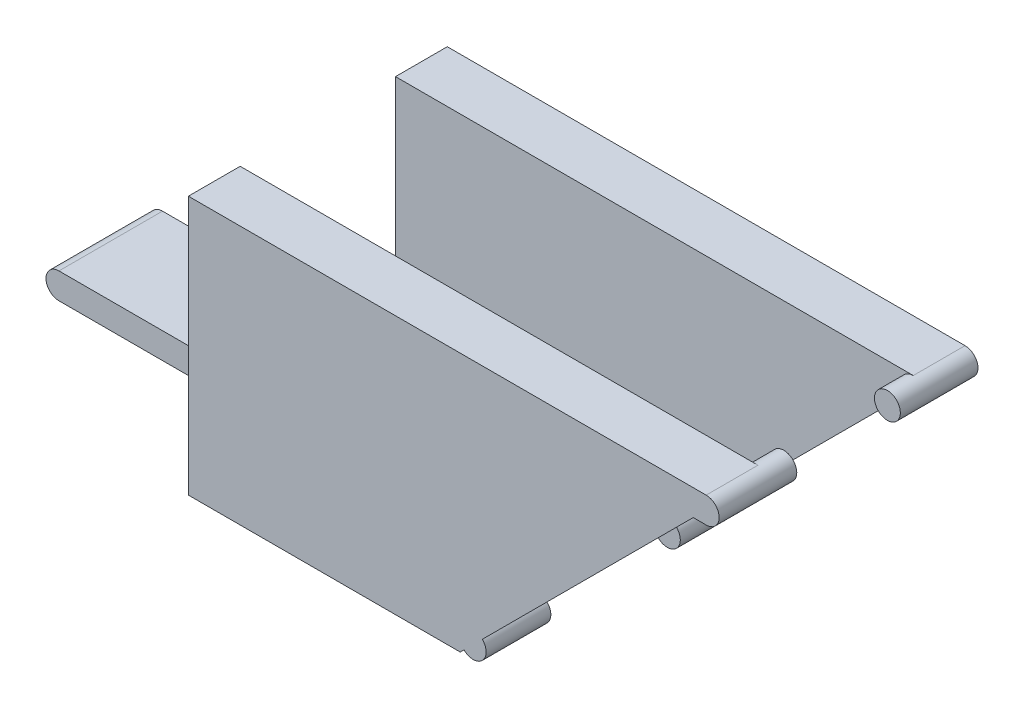
ISO-10303-21;
HEADER;
FILE_DESCRIPTION(('STEP AP214'),'2;1');
FILE_NAME('part.step','',(''),(''),'','','');
FILE_SCHEMA(('AUTOMOTIVE_DESIGN { 1 0 10303 214 1 1 1 1 }'));
ENDSEC;
DATA;
#1=APPLICATION_CONTEXT('core data for automotive mechanical design processes');
#2=APPLICATION_PROTOCOL_DEFINITION('international standard','automotive_design',2000,#1);
#3=PRODUCT_CONTEXT('',#1,'mechanical');
#4=PRODUCT('Part','Part','',(#3));
#5=PRODUCT_RELATED_PRODUCT_CATEGORY('part','',(#4));
#6=PRODUCT_DEFINITION_FORMATION('','',#4);
#7=PRODUCT_DEFINITION_CONTEXT('part definition',#1,'design');
#8=PRODUCT_DEFINITION('design','',#6,#7);
#9=PRODUCT_DEFINITION_SHAPE('','',#8);
#10=(LENGTH_UNIT() NAMED_UNIT(*) SI_UNIT(.MILLI.,.METRE.));
#11=(NAMED_UNIT(*) PLANE_ANGLE_UNIT() SI_UNIT($,.RADIAN.));
#12=(NAMED_UNIT(*) SI_UNIT($,.STERADIAN.) SOLID_ANGLE_UNIT());
#13=UNCERTAINTY_MEASURE_WITH_UNIT(LENGTH_MEASURE(1.E-05),#10,'distance_accuracy_value','');
#14=(GEOMETRIC_REPRESENTATION_CONTEXT(3) GLOBAL_UNCERTAINTY_ASSIGNED_CONTEXT((#13)) GLOBAL_UNIT_ASSIGNED_CONTEXT((#10,
#11,#12)) REPRESENTATION_CONTEXT('',''));
#15=CARTESIAN_POINT('',(0.,0.,0.));
#16=DIRECTION('',(0.,0.,1.));
#17=DIRECTION('',(1.,0.,0.));
#18=AXIS2_PLACEMENT_3D('',#15,#16,#17);
#19=CARTESIAN_POINT('',(37.,18.,-10.));
#20=DIRECTION('',(-0.707106781186553,0.707106781186542,0.));
#21=DIRECTION('',(-0.707106781186542,-0.707106781186553,0.));
#22=AXIS2_PLACEMENT_3D('',#19,#20,#21);
#23=PLANE('',#22);
#24=DIRECTION('',(0.707106781186542,0.707106781186553,0.));
#25=VECTOR('',#24,1.);
#26=CARTESIAN_POINT('',(39.6624393450778,20.6624393450778,-6.));
#27=LINE('',#26,#25);
#28=CARTESIAN_POINT('',(20.7071067811867,1.7071067811864,-6.));
#29=VERTEX_POINT('',#28);
#30=CARTESIAN_POINT('',(37.,18.,-6.));
#31=VERTEX_POINT('',#30);
#32=EDGE_CURVE('E206',#29,#31,#27,.T.);
#33=ORIENTED_EDGE('',*,*,#32,.F.);
#34=DIRECTION('',(0.,0.,-1.));
#35=VECTOR('',#34,1.);
#36=CARTESIAN_POINT('',(20.7071067811867,1.7071067811864,-5.));
#37=LINE('',#36,#35);
#38=CARTESIAN_POINT('',(20.7071067811867,1.7071067811864,-10.));
#39=VERTEX_POINT('',#38);
#40=EDGE_CURVE('E11',#29,#39,#37,.T.);
#41=ORIENTED_EDGE('',*,*,#40,.T.);
#42=DIRECTION('',(-0.707106781186542,-0.707106781186553,0.));
#43=VECTOR('',#42,1.);
#44=CARTESIAN_POINT('',(37.,18.,-10.));
#45=LINE('',#44,#43);
#46=CARTESIAN_POINT('',(37.,18.,-10.));
#47=VERTEX_POINT('',#46);
#48=EDGE_CURVE('E204',#47,#39,#45,.T.);
#49=ORIENTED_EDGE('',*,*,#48,.F.);
#50=DIRECTION('',(0.,0.,1.));
#51=VECTOR('',#50,1.);
#52=CARTESIAN_POINT('',(37.,18.,-10.));
#53=LINE('',#52,#51);
#54=EDGE_CURVE('E223',#47,#31,#53,.T.);
#55=ORIENTED_EDGE('',*,*,#54,.T.);
#56=EDGE_LOOP('',(#33,#41,#49,#55));
#57=FACE_BOUND('',#56,.T.);
#58=ADVANCED_FACE('F34',(#57),#23,.F.);
#59=DIRECTION('',(-0.707106781186542,-0.707106781186553,0.));
#60=VECTOR('',#59,1.);
#61=CARTESIAN_POINT('',(39.6624393450778,20.6624393450778,6.));
#62=LINE('',#61,#60);
#63=CARTESIAN_POINT('',(19.2928932188136,0.292893218813289,6.));
#64=VERTEX_POINT('',#63);
#65=CARTESIAN_POINT('',(19.0000000000003,0.,6.));
#66=VERTEX_POINT('',#65);
#67=EDGE_CURVE('E364',#64,#66,#62,.T.);
#68=ORIENTED_EDGE('',*,*,#67,.F.);
#69=DIRECTION('',(0.,0.,1.));
#70=VECTOR('',#69,1.);
#71=CARTESIAN_POINT('',(19.2928932188136,0.292893218813291,5.));
#72=LINE('',#71,#70);
#73=CARTESIAN_POINT('',(19.2928932188136,0.292893218813291,10.));
#74=VERTEX_POINT('',#73);
#75=EDGE_CURVE('E369',#64,#74,#72,.T.);
#76=ORIENTED_EDGE('',*,*,#75,.T.);
#77=DIRECTION('',(-0.707106781186542,-0.707106781186553,0.));
#78=VECTOR('',#77,1.);
#79=CARTESIAN_POINT('',(37.,18.,10.));
#80=LINE('',#79,#78);
#81=CARTESIAN_POINT('',(19.0000000000003,0.,10.));
#82=VERTEX_POINT('',#81);
#83=EDGE_CURVE('E220',#74,#82,#80,.T.);
#84=ORIENTED_EDGE('',*,*,#83,.T.);
#85=DIRECTION('',(0.,0.,1.));
#86=VECTOR('',#85,1.);
#87=CARTESIAN_POINT('',(19.0000000000003,0.,-10.));
#88=LINE('',#87,#86);
#89=EDGE_CURVE('E212',#66,#82,#88,.T.);
#90=ORIENTED_EDGE('',*,*,#89,.F.);
#91=EDGE_LOOP('',(#68,#76,#84,#90));
#92=FACE_BOUND('',#91,.T.);
#93=ADVANCED_FACE('F482',(#92),#23,.F.);
#94=CARTESIAN_POINT('',(38.,19.,10.));
#95=DIRECTION('',(0.,0.,-1.));
#96=DIRECTION('',(-1.,0.,0.));
#97=AXIS2_PLACEMENT_3D('',#94,#95,#96);
#98=CYLINDRICAL_SURFACE('',#97,0.999999999999998);
#99=CARTESIAN_POINT('',(38.,19.,4.00000000000001));
#100=DIRECTION('',(0.,0.,1.));
#101=DIRECTION('',(1.,0.,0.));
#102=AXIS2_PLACEMENT_3D('',#99,#100,#101);
#103=CIRCLE('',#102,0.999999999999998);
#104=CARTESIAN_POINT('',(39.,19.,4.00000000000001));
#105=VERTEX_POINT('',#104);
#106=EDGE_CURVE('E262',#105,#105,#103,.T.);
#107=ORIENTED_EDGE('',*,*,#106,.T.);
#108=EDGE_LOOP('',(#107));
#109=FACE_BOUND('',#108,.T.);
#110=CARTESIAN_POINT('',(38.,19.,10.));
#111=DIRECTION('',(0.,0.,1.));
#112=DIRECTION('',(1.,0.,0.));
#113=AXIS2_PLACEMENT_3D('',#110,#111,#112);
#114=CIRCLE('',#113,0.999999999999998);
#115=CARTESIAN_POINT('',(38.,18.,10.));
#116=VERTEX_POINT('',#115);
#117=CARTESIAN_POINT('',(38.,20.,10.));
#118=VERTEX_POINT('',#117);
#119=EDGE_CURVE('E266',#116,#118,#114,.T.);
#120=ORIENTED_EDGE('',*,*,#119,.F.);
#121=DIRECTION('',(0.,0.,-1.));
#122=VECTOR('',#121,1.);
#123=CARTESIAN_POINT('',(38.,18.,10.));
#124=LINE('',#123,#122);
#125=CARTESIAN_POINT('',(38.,18.,6.));
#126=VERTEX_POINT('',#125);
#127=EDGE_CURVE('E269',#116,#126,#124,.T.);
#128=ORIENTED_EDGE('',*,*,#127,.T.);
#129=CARTESIAN_POINT('',(38.,19.,6.));
#130=DIRECTION('',(0.,0.,1.));
#131=DIRECTION('',(0.,-1.,0.));
#132=AXIS2_PLACEMENT_3D('',#129,#130,#131);
#133=CIRCLE('',#132,0.999999999999998);
#134=CARTESIAN_POINT('',(38.,20.,6.));
#135=VERTEX_POINT('',#134);
#136=EDGE_CURVE('E358',#126,#135,#133,.F.);
#137=ORIENTED_EDGE('',*,*,#136,.T.);
#138=DIRECTION('',(0.,0.,-1.));
#139=VECTOR('',#138,1.);
#140=CARTESIAN_POINT('',(38.,20.,-10.));
#141=LINE('',#140,#139);
#142=EDGE_CURVE('E335',#118,#135,#141,.T.);
#143=ORIENTED_EDGE('',*,*,#142,.F.);
#144=EDGE_LOOP('',(#120,#128,#137,#143));
#145=FACE_BOUND('',#144,.T.);
#146=ADVANCED_FACE('F449',(#109,#145),#98,.T.);
#147=CARTESIAN_POINT('',(-18.,4.,-4.));
#148=DIRECTION('',(0.,-1.,0.));
#149=DIRECTION('',(0.,0.,-1.));
#150=AXIS2_PLACEMENT_3D('',#147,#148,#149);
#151=PLANE('',#150);
#152=DIRECTION('',(0.,0.,1.));
#153=VECTOR('',#152,1.);
#154=CARTESIAN_POINT('',(18.,4.,5.99999999999999));
#155=LINE('',#154,#153);
#156=CARTESIAN_POINT('',(18.,4.,-6.00000000000001));
#157=VERTEX_POINT('',#156);
#158=CARTESIAN_POINT('',(18.,4.,6.));
#159=VERTEX_POINT('',#158);
#160=EDGE_CURVE('E288',#157,#159,#155,.T.);
#161=ORIENTED_EDGE('',*,*,#160,.F.);
#162=DIRECTION('',(-1.,0.,0.));
#163=VECTOR('',#162,1.);
#164=CARTESIAN_POINT('',(38.,4.,-6.));
#165=LINE('',#164,#163);
#166=CARTESIAN_POINT('',(-1.99999999999999,4.,-6.));
#167=VERTEX_POINT('',#166);
#168=EDGE_CURVE('E304',#157,#167,#165,.T.);
#169=ORIENTED_EDGE('',*,*,#168,.T.);
#170=DIRECTION('',(0.,0.,1.));
#171=VECTOR('',#170,1.);
#172=CARTESIAN_POINT('',(-1.99999999999999,4.,-6.));
#173=LINE('',#172,#171);
#174=CARTESIAN_POINT('',(-1.99999999999999,4.,-4.));
#175=VERTEX_POINT('',#174);
#176=EDGE_CURVE('E300',#167,#175,#173,.T.);
#177=ORIENTED_EDGE('',*,*,#176,.T.);
#178=DIRECTION('',(1.,0.,0.));
#179=VECTOR('',#178,1.);
#180=CARTESIAN_POINT('',(-18.,4.,-4.));
#181=LINE('',#180,#179);
#182=CARTESIAN_POINT('',(-18.,4.,-4.));
#183=VERTEX_POINT('',#182);
#184=EDGE_CURVE('E312',#183,#175,#181,.T.);
#185=ORIENTED_EDGE('',*,*,#184,.F.);
#186=DIRECTION('',(0.,0.,-1.));
#187=VECTOR('',#186,1.);
#188=CARTESIAN_POINT('',(-18.,4.,-4.));
#189=LINE('',#188,#187);
#190=CARTESIAN_POINT('',(-18.,4.,4.));
#191=VERTEX_POINT('',#190);
#192=EDGE_CURVE('E309',#191,#183,#189,.T.);
#193=ORIENTED_EDGE('',*,*,#192,.F.);
#194=DIRECTION('',(1.,0.,0.));
#195=VECTOR('',#194,1.);
#196=CARTESIAN_POINT('',(-18.,4.,4.));
#197=LINE('',#196,#195);
#198=CARTESIAN_POINT('',(-1.99999999999999,4.,4.));
#199=VERTEX_POINT('',#198);
#200=EDGE_CURVE('E320',#191,#199,#197,.T.);
#201=ORIENTED_EDGE('',*,*,#200,.T.);
#202=CARTESIAN_POINT('',(-1.99999999999999,4.,6.));
#203=VERTEX_POINT('',#202);
#204=EDGE_CURVE('E299',#199,#203,#173,.T.);
#205=ORIENTED_EDGE('',*,*,#204,.T.);
#206=DIRECTION('',(-1.,0.,0.));
#207=VECTOR('',#206,1.);
#208=CARTESIAN_POINT('',(38.,4.,6.));
#209=LINE('',#208,#207);
#210=EDGE_CURVE('E305',#159,#203,#209,.T.);
#211=ORIENTED_EDGE('',*,*,#210,.F.);
#212=EDGE_LOOP('',(#161,#169,#177,#185,#193,#201,#205,#211));
#213=FACE_BOUND('',#212,.T.);
#214=ADVANCED_FACE('F403',(#213),#151,.F.);
#215=CARTESIAN_POINT('',(-1.99999999999999,20.,-10.));
#216=DIRECTION('',(1.,0.,0.));
#217=DIRECTION('',(0.,0.,-1.));
#218=AXIS2_PLACEMENT_3D('',#215,#216,#217);
#219=PLANE('',#218);
#220=DIRECTION('',(0.,0.,1.));
#221=VECTOR('',#220,1.);
#222=CARTESIAN_POINT('',(-1.99999999999999,20.,-10.));
#223=LINE('',#222,#221);
#224=CARTESIAN_POINT('',(-1.99999999999999,20.,6.));
#225=VERTEX_POINT('',#224);
#226=CARTESIAN_POINT('',(-1.99999999999999,20.,10.));
#227=VERTEX_POINT('',#226);
#228=EDGE_CURVE('E332',#225,#227,#223,.T.);
#229=ORIENTED_EDGE('',*,*,#228,.F.);
#230=DIRECTION('',(0.,1.,0.));
#231=VECTOR('',#230,1.);
#232=CARTESIAN_POINT('',(-1.99999999999999,22.3248786901555,6.));
#233=LINE('',#232,#231);
#234=EDGE_CURVE('E302',#203,#225,#233,.T.);
#235=ORIENTED_EDGE('',*,*,#234,.F.);
#236=ORIENTED_EDGE('',*,*,#204,.F.);
#237=DIRECTION('',(0.,1.,0.));
#238=VECTOR('',#237,1.);
#239=CARTESIAN_POINT('',(-1.99999999999999,0.,4.));
#240=LINE('',#239,#238);
#241=CARTESIAN_POINT('',(-1.99999999999999,0.,4.));
#242=VERTEX_POINT('',#241);
#243=EDGE_CURVE('E313',#242,#199,#240,.T.);
#244=ORIENTED_EDGE('',*,*,#243,.F.);
#245=DIRECTION('',(0.,0.,1.));
#246=VECTOR('',#245,1.);
#247=CARTESIAN_POINT('',(-1.99999999999999,0.,-10.));
#248=LINE('',#247,#246);
#249=CARTESIAN_POINT('',(-1.99999999999999,0.,10.));
#250=VERTEX_POINT('',#249);
#251=EDGE_CURVE('E327',#242,#250,#248,.T.);
#252=ORIENTED_EDGE('',*,*,#251,.T.);
#253=DIRECTION('',(0.,-1.,0.));
#254=VECTOR('',#253,1.);
#255=CARTESIAN_POINT('',(-1.99999999999999,20.,10.));
#256=LINE('',#255,#254);
#257=EDGE_CURVE('E350',#227,#250,#256,.T.);
#258=ORIENTED_EDGE('',*,*,#257,.F.);
#259=EDGE_LOOP('',(#229,#235,#236,#244,#252,#258));
#260=FACE_BOUND('',#259,.T.);
#261=ADVANCED_FACE('F423',(#260),#219,.F.);
#262=CARTESIAN_POINT('',(0.,20.,0.));
#263=DIRECTION('',(0.,1.,0.));
#264=DIRECTION('',(0.,0.,1.));
#265=AXIS2_PLACEMENT_3D('',#262,#263,#264);
#266=PLANE('',#265);
#267=DIRECTION('',(-1.,0.,0.));
#268=VECTOR('',#267,1.);
#269=CARTESIAN_POINT('',(0.,20.,-6.));
#270=LINE('',#269,#268);
#271=CARTESIAN_POINT('',(38.,20.,-6.));
#272=VERTEX_POINT('',#271);
#273=CARTESIAN_POINT('',(-1.99999999999999,20.,-6.));
#274=VERTEX_POINT('',#273);
#275=EDGE_CURVE('E356',#272,#274,#270,.T.);
#276=ORIENTED_EDGE('',*,*,#275,.F.);
#277=CARTESIAN_POINT('',(38.,20.,-10.));
#278=VERTEX_POINT('',#277);
#279=EDGE_CURVE('E334',#272,#278,#141,.T.);
#280=ORIENTED_EDGE('',*,*,#279,.T.);
#281=DIRECTION('',(-1.,0.,0.));
#282=VECTOR('',#281,1.);
#283=CARTESIAN_POINT('',(-1.99999999999999,20.,-10.));
#284=LINE('',#283,#282);
#285=CARTESIAN_POINT('',(-1.99999999999999,20.,-10.));
#286=VERTEX_POINT('',#285);
#287=EDGE_CURVE('E337',#278,#286,#284,.T.);
#288=ORIENTED_EDGE('',*,*,#287,.T.);
#289=EDGE_CURVE('E328',#286,#274,#223,.T.);
#290=ORIENTED_EDGE('',*,*,#289,.T.);
#291=EDGE_LOOP('',(#276,#280,#288,#290));
#292=FACE_BOUND('',#291,.T.);
#293=ADVANCED_FACE('F393',(#292),#266,.T.);
#294=ORIENTED_EDGE('',*,*,#176,.F.);
#295=DIRECTION('',(0.,-1.,0.));
#296=VECTOR('',#295,1.);
#297=CARTESIAN_POINT('',(-1.99999999999999,22.3248786901555,-6.));
#298=LINE('',#297,#296);
#299=EDGE_CURVE('E294',#274,#167,#298,.T.);
#300=ORIENTED_EDGE('',*,*,#299,.F.);
#301=ORIENTED_EDGE('',*,*,#289,.F.);
#302=DIRECTION('',(0.,-1.,0.));
#303=VECTOR('',#302,1.);
#304=CARTESIAN_POINT('',(-1.99999999999999,20.,-10.));
#305=LINE('',#304,#303);
#306=CARTESIAN_POINT('',(-1.99999999999999,0.,-10.));
#307=VERTEX_POINT('',#306);
#308=EDGE_CURVE('E339',#286,#307,#305,.T.);
#309=ORIENTED_EDGE('',*,*,#308,.T.);
#310=CARTESIAN_POINT('',(-1.99999999999999,0.,-4.));
#311=VERTEX_POINT('',#310);
#312=EDGE_CURVE('E340',#307,#311,#248,.T.);
#313=ORIENTED_EDGE('',*,*,#312,.T.);
#314=DIRECTION('',(0.,-1.,0.));
#315=VECTOR('',#314,1.);
#316=CARTESIAN_POINT('',(-1.99999999999999,0.,-4.));
#317=LINE('',#316,#315);
#318=EDGE_CURVE('E307',#175,#311,#317,.T.);
#319=ORIENTED_EDGE('',*,*,#318,.F.);
#320=EDGE_LOOP('',(#294,#300,#301,#309,#313,#319));
#321=FACE_BOUND('',#320,.T.);
#322=ADVANCED_FACE('F36',(#321),#219,.F.);
#323=CARTESIAN_POINT('',(-1.99999999999999,20.,10.));
#324=DIRECTION('',(0.,0.,-1.));
#325=DIRECTION('',(-1.,0.,0.));
#326=AXIS2_PLACEMENT_3D('',#323,#324,#325);
#327=PLANE('',#326);
#328=ORIENTED_EDGE('',*,*,#83,.F.);
#329=CARTESIAN_POINT('',(20.,1.,10.));
#330=DIRECTION('',(0.,0.,1.));
#331=DIRECTION('',(1.,0.,0.));
#332=AXIS2_PLACEMENT_3D('',#329,#330,#331);
#333=CIRCLE('',#332,1.);
#334=CARTESIAN_POINT('',(20.7071067811867,1.7071067811864,10.));
#335=VERTEX_POINT('',#334);
#336=EDGE_CURVE('E463',#74,#335,#333,.T.);
#337=ORIENTED_EDGE('',*,*,#336,.T.);
#338=CARTESIAN_POINT('',(37.,18.,10.));
#339=VERTEX_POINT('',#338);
#340=EDGE_CURVE('E218',#339,#335,#80,.T.);
#341=ORIENTED_EDGE('',*,*,#340,.F.);
#342=DIRECTION('',(-1.,0.,0.));
#343=VECTOR('',#342,1.);
#344=CARTESIAN_POINT('',(38.,18.,10.));
#345=LINE('',#344,#343);
#346=EDGE_CURVE('E214',#116,#339,#345,.T.);
#347=ORIENTED_EDGE('',*,*,#346,.F.);
#348=ORIENTED_EDGE('',*,*,#119,.T.);
#349=DIRECTION('',(1.,0.,0.));
#350=VECTOR('',#349,1.);
#351=CARTESIAN_POINT('',(-1.99999999999999,20.,10.));
#352=LINE('',#351,#350);
#353=EDGE_CURVE('E331',#227,#118,#352,.T.);
#354=ORIENTED_EDGE('',*,*,#353,.F.);
#355=ORIENTED_EDGE('',*,*,#257,.T.);
#356=DIRECTION('',(1.,0.,0.));
#357=VECTOR('',#356,1.);
#358=CARTESIAN_POINT('',(-1.99999999999999,0.,10.));
#359=LINE('',#358,#357);
#360=EDGE_CURVE('E343',#250,#82,#359,.T.);
#361=ORIENTED_EDGE('',*,*,#360,.T.);
#362=EDGE_LOOP('',(#328,#337,#341,#347,#348,#354,#355,#361));
#363=FACE_BOUND('',#362,.T.);
#364=ADVANCED_FACE('F417',(#363),#327,.F.);
#365=CARTESIAN_POINT('',(-1.99999999999999,20.,-10.));
#366=DIRECTION('',(0.,0.,1.));
#367=DIRECTION('',(1.,0.,0.));
#368=AXIS2_PLACEMENT_3D('',#365,#366,#367);
#369=PLANE('',#368);
#370=ORIENTED_EDGE('',*,*,#48,.T.);
#371=CARTESIAN_POINT('',(20.,1.,-10.));
#372=DIRECTION('',(0.,0.,-1.));
#373=DIRECTION('',(-1.,0.,0.));
#374=AXIS2_PLACEMENT_3D('',#371,#372,#373);
#375=CIRCLE('',#374,1.);
#376=CARTESIAN_POINT('',(19.2928932188136,0.292893218813293,-10.));
#377=VERTEX_POINT('',#376);
#378=EDGE_CURVE('E49',#39,#377,#375,.T.);
#379=ORIENTED_EDGE('',*,*,#378,.T.);
#380=CARTESIAN_POINT('',(19.0000000000003,0.,-10.));
#381=VERTEX_POINT('',#380);
#382=EDGE_CURVE('E210',#377,#381,#45,.T.);
#383=ORIENTED_EDGE('',*,*,#382,.T.);
#384=DIRECTION('',(-1.,0.,0.));
#385=VECTOR('',#384,1.);
#386=CARTESIAN_POINT('',(-1.99999999999999,0.,-10.));
#387=LINE('',#386,#385);
#388=EDGE_CURVE('E346',#381,#307,#387,.T.);
#389=ORIENTED_EDGE('',*,*,#388,.T.);
#390=ORIENTED_EDGE('',*,*,#308,.F.);
#391=ORIENTED_EDGE('',*,*,#287,.F.);
#392=CARTESIAN_POINT('',(38.,19.,-10.));
#393=DIRECTION('',(0.,0.,1.));
#394=DIRECTION('',(1.,0.,0.));
#395=AXIS2_PLACEMENT_3D('',#392,#393,#394);
#396=CIRCLE('',#395,0.999999999999998);
#397=CARTESIAN_POINT('',(38.,18.,-10.));
#398=VERTEX_POINT('',#397);
#399=EDGE_CURVE('E265',#398,#278,#396,.T.);
#400=ORIENTED_EDGE('',*,*,#399,.F.);
#401=DIRECTION('',(-1.,0.,0.));
#402=VECTOR('',#401,1.);
#403=CARTESIAN_POINT('',(38.,18.,-10.));
#404=LINE('',#403,#402);
#405=EDGE_CURVE('E209',#398,#47,#404,.T.);
#406=ORIENTED_EDGE('',*,*,#405,.T.);
#407=EDGE_LOOP('',(#370,#379,#383,#389,#390,#391,#400,#406));
#408=FACE_BOUND('',#407,.T.);
#409=ADVANCED_FACE('F207',(#408),#369,.F.);
#410=DIRECTION('',(1.,0.,0.));
#411=VECTOR('',#410,1.);
#412=CARTESIAN_POINT('',(0.,20.,6.));
#413=LINE('',#412,#411);
#414=EDGE_CURVE('E353',#225,#135,#413,.T.);
#415=ORIENTED_EDGE('',*,*,#414,.F.);
#416=ORIENTED_EDGE('',*,*,#228,.T.);
#417=ORIENTED_EDGE('',*,*,#353,.T.);
#418=ORIENTED_EDGE('',*,*,#142,.T.);
#419=EDGE_LOOP('',(#415,#416,#417,#418));
#420=FACE_BOUND('',#419,.T.);
#421=ADVANCED_FACE('F445',(#420),#266,.T.);
#422=CARTESIAN_POINT('',(0.,0.,0.));
#423=DIRECTION('',(0.,1.,0.));
#424=DIRECTION('',(0.,0.,1.));
#425=AXIS2_PLACEMENT_3D('',#422,#423,#424);
#426=PLANE('',#425);
#427=ORIENTED_EDGE('',*,*,#388,.F.);
#428=CARTESIAN_POINT('',(19.0000000000003,0.,-6.));
#429=VERTEX_POINT('',#428);
#430=EDGE_CURVE('E227',#381,#429,#88,.T.);
#431=ORIENTED_EDGE('',*,*,#430,.T.);
#432=DIRECTION('',(1.,0.,0.));
#433=VECTOR('',#432,1.);
#434=CARTESIAN_POINT('',(18.,0.,-6.00000000000001));
#435=LINE('',#434,#433);
#436=CARTESIAN_POINT('',(18.,0.,-6.00000000000001));
#437=VERTEX_POINT('',#436);
#438=EDGE_CURVE('E291',#437,#429,#435,.T.);
#439=ORIENTED_EDGE('',*,*,#438,.F.);
#440=DIRECTION('',(0.,0.,-1.));
#441=VECTOR('',#440,1.);
#442=CARTESIAN_POINT('',(18.,0.,5.99999999999999));
#443=LINE('',#442,#441);
#444=CARTESIAN_POINT('',(18.,0.,5.99999999999999));
#445=VERTEX_POINT('',#444);
#446=EDGE_CURVE('E283',#445,#437,#443,.T.);
#447=ORIENTED_EDGE('',*,*,#446,.F.);
#448=DIRECTION('',(1.,0.,0.));
#449=VECTOR('',#448,1.);
#450=CARTESIAN_POINT('',(18.,0.,5.99999999999999));
#451=LINE('',#450,#449);
#452=EDGE_CURVE('E290',#445,#66,#451,.T.);
#453=ORIENTED_EDGE('',*,*,#452,.T.);
#454=ORIENTED_EDGE('',*,*,#89,.T.);
#455=ORIENTED_EDGE('',*,*,#360,.F.);
#456=ORIENTED_EDGE('',*,*,#251,.F.);
#457=DIRECTION('',(1.,0.,0.));
#458=VECTOR('',#457,1.);
#459=CARTESIAN_POINT('',(-18.,0.,4.));
#460=LINE('',#459,#458);
#461=CARTESIAN_POINT('',(-5.,0.,4.));
#462=VERTEX_POINT('',#461);
#463=EDGE_CURVE('E323',#462,#242,#460,.T.);
#464=ORIENTED_EDGE('',*,*,#463,.F.);
#465=DIRECTION('',(0.,0.,1.));
#466=VECTOR('',#465,1.);
#467=CARTESIAN_POINT('',(-5.,0.,-16.));
#468=LINE('',#467,#466);
#469=CARTESIAN_POINT('',(-5.,0.,-4.));
#470=VERTEX_POINT('',#469);
#471=EDGE_CURVE('E250',#470,#462,#468,.T.);
#472=ORIENTED_EDGE('',*,*,#471,.F.);
#473=DIRECTION('',(1.,0.,0.));
#474=VECTOR('',#473,1.);
#475=CARTESIAN_POINT('',(-18.,0.,-4.));
#476=LINE('',#475,#474);
#477=EDGE_CURVE('E325',#470,#311,#476,.T.);
#478=ORIENTED_EDGE('',*,*,#477,.T.);
#479=ORIENTED_EDGE('',*,*,#312,.F.);
#480=EDGE_LOOP('',(#427,#431,#439,#447,#453,#454,#455,#456,#464,#472,#478,#479));
#481=FACE_BOUND('',#480,.T.);
#482=ADVANCED_FACE('F382',(#481),#426,.F.);
#483=CARTESIAN_POINT('',(-18.,0.,-4.));
#484=DIRECTION('',(0.,0.,1.));
#485=DIRECTION('',(1.,0.,0.));
#486=AXIS2_PLACEMENT_3D('',#483,#484,#485);
#487=PLANE('',#486);
#488=DIRECTION('',(-1.,0.,0.));
#489=VECTOR('',#488,1.);
#490=CARTESIAN_POINT('',(-18.,2.,-4.));
#491=LINE('',#490,#489);
#492=CARTESIAN_POINT('',(-5.,2.,-4.));
#493=VERTEX_POINT('',#492);
#494=CARTESIAN_POINT('',(-18.,2.,-4.));
#495=VERTEX_POINT('',#494);
#496=EDGE_CURVE('E252',#493,#495,#491,.T.);
#497=ORIENTED_EDGE('',*,*,#496,.T.);
#498=CARTESIAN_POINT('',(-18.,3.,-4.));
#499=DIRECTION('',(0.,0.,1.));
#500=DIRECTION('',(1.,0.,0.));
#501=AXIS2_PLACEMENT_3D('',#498,#499,#500);
#502=CIRCLE('',#501,1.);
#503=EDGE_CURVE('E239',#183,#495,#502,.T.);
#504=ORIENTED_EDGE('',*,*,#503,.F.);
#505=ORIENTED_EDGE('',*,*,#184,.T.);
#506=ORIENTED_EDGE('',*,*,#318,.T.);
#507=ORIENTED_EDGE('',*,*,#477,.F.);
#508=CARTESIAN_POINT('',(-5.,1.,-4.));
#509=DIRECTION('',(0.,0.,1.));
#510=DIRECTION('',(1.,0.,0.));
#511=AXIS2_PLACEMENT_3D('',#508,#509,#510);
#512=CIRCLE('',#511,1.);
#513=EDGE_CURVE('E256',#470,#493,#512,.F.);
#514=ORIENTED_EDGE('',*,*,#513,.T.);
#515=EDGE_LOOP('',(#497,#504,#505,#506,#507,#514));
#516=FACE_BOUND('',#515,.T.);
#517=ADVANCED_FACE('F437',(#516),#487,.F.);
#518=CARTESIAN_POINT('',(-18.,0.,4.));
#519=DIRECTION('',(0.,0.,-1.));
#520=DIRECTION('',(-1.,0.,0.));
#521=AXIS2_PLACEMENT_3D('',#518,#519,#520);
#522=PLANE('',#521);
#523=ORIENTED_EDGE('',*,*,#200,.F.);
#524=CARTESIAN_POINT('',(-18.,3.,4.));
#525=DIRECTION('',(0.,0.,1.));
#526=DIRECTION('',(1.,0.,0.));
#527=AXIS2_PLACEMENT_3D('',#524,#525,#526);
#528=CIRCLE('',#527,1.);
#529=CARTESIAN_POINT('',(-18.,2.,4.));
#530=VERTEX_POINT('',#529);
#531=EDGE_CURVE('E238',#191,#530,#528,.T.);
#532=ORIENTED_EDGE('',*,*,#531,.T.);
#533=DIRECTION('',(-1.,0.,0.));
#534=VECTOR('',#533,1.);
#535=CARTESIAN_POINT('',(-5.,2.,4.));
#536=LINE('',#535,#534);
#537=CARTESIAN_POINT('',(-5.,2.,4.));
#538=VERTEX_POINT('',#537);
#539=EDGE_CURVE('E247',#538,#530,#536,.T.);
#540=ORIENTED_EDGE('',*,*,#539,.F.);
#541=CARTESIAN_POINT('',(-5.,1.,4.));
#542=DIRECTION('',(0.,0.,-1.));
#543=DIRECTION('',(1.,0.,0.));
#544=AXIS2_PLACEMENT_3D('',#541,#542,#543);
#545=CIRCLE('',#544,1.);
#546=EDGE_CURVE('E242',#462,#538,#545,.T.);
#547=ORIENTED_EDGE('',*,*,#546,.F.);
#548=ORIENTED_EDGE('',*,*,#463,.T.);
#549=ORIENTED_EDGE('',*,*,#243,.T.);
#550=EDGE_LOOP('',(#523,#532,#540,#547,#548,#549));
#551=FACE_BOUND('',#550,.T.);
#552=ADVANCED_FACE('F431',(#551),#522,.F.);
#553=CARTESIAN_POINT('',(38.,22.3248786901555,-6.));
#554=DIRECTION('',(0.,0.,-1.));
#555=DIRECTION('',(0.,1.,0.));
#556=AXIS2_PLACEMENT_3D('',#553,#554,#555);
#557=PLANE('',#556);
#558=CARTESIAN_POINT('',(19.2928932188136,0.292893218813291,-6.));
#559=VERTEX_POINT('',#558);
#560=EDGE_CURVE('E235',#429,#559,#27,.T.);
#561=ORIENTED_EDGE('',*,*,#560,.T.);
#562=CARTESIAN_POINT('',(20.,1.,-6.));
#563=DIRECTION('',(0.,0.,-1.));
#564=DIRECTION('',(0.,1.,0.));
#565=AXIS2_PLACEMENT_3D('',#562,#563,#564);
#566=CIRCLE('',#565,1.);
#567=EDGE_CURVE('E376',#559,#29,#566,.T.);
#568=ORIENTED_EDGE('',*,*,#567,.T.);
#569=ORIENTED_EDGE('',*,*,#32,.T.);
#570=DIRECTION('',(1.,0.,0.));
#571=VECTOR('',#570,1.);
#572=CARTESIAN_POINT('',(38.,18.,-6.));
#573=LINE('',#572,#571);
#574=CARTESIAN_POINT('',(38.,18.,-6.));
#575=VERTEX_POINT('',#574);
#576=EDGE_CURVE('E232',#31,#575,#573,.T.);
#577=ORIENTED_EDGE('',*,*,#576,.T.);
#578=CARTESIAN_POINT('',(38.,19.,-6.));
#579=DIRECTION('',(0.,0.,-1.));
#580=DIRECTION('',(0.,1.,0.));
#581=AXIS2_PLACEMENT_3D('',#578,#579,#580);
#582=CIRCLE('',#581,0.999999999999998);
#583=EDGE_CURVE('E274',#272,#575,#582,.F.);
#584=ORIENTED_EDGE('',*,*,#583,.F.);
#585=ORIENTED_EDGE('',*,*,#275,.T.);
#586=ORIENTED_EDGE('',*,*,#299,.T.);
#587=ORIENTED_EDGE('',*,*,#168,.F.);
#588=DIRECTION('',(0.,1.,0.));
#589=VECTOR('',#588,1.);
#590=CARTESIAN_POINT('',(18.,4.,-6.00000000000001));
#591=LINE('',#590,#589);
#592=EDGE_CURVE('E286',#437,#157,#591,.T.);
#593=ORIENTED_EDGE('',*,*,#592,.F.);
#594=ORIENTED_EDGE('',*,*,#438,.T.);
#595=EDGE_LOOP('',(#561,#568,#569,#577,#584,#585,#586,#587,#593,#594));
#596=FACE_BOUND('',#595,.T.);
#597=ADVANCED_FACE('F375',(#596),#557,.F.);
#598=CARTESIAN_POINT('',(38.,22.3248786901555,6.));
#599=DIRECTION('',(0.,0.,1.));
#600=DIRECTION('',(0.,-1.,0.));
#601=AXIS2_PLACEMENT_3D('',#598,#599,#600);
#602=PLANE('',#601);
#603=CARTESIAN_POINT('',(37.,18.,6.));
#604=VERTEX_POINT('',#603);
#605=CARTESIAN_POINT('',(20.7071067811867,1.7071067811864,6.));
#606=VERTEX_POINT('',#605);
#607=EDGE_CURVE('E365',#604,#606,#62,.T.);
#608=ORIENTED_EDGE('',*,*,#607,.T.);
#609=CARTESIAN_POINT('',(20.,1.,6.));
#610=DIRECTION('',(0.,0.,1.));
#611=DIRECTION('',(0.,-1.,0.));
#612=AXIS2_PLACEMENT_3D('',#609,#610,#611);
#613=CIRCLE('',#612,1.);
#614=EDGE_CURVE('E57',#606,#64,#613,.T.);
#615=ORIENTED_EDGE('',*,*,#614,.T.);
#616=ORIENTED_EDGE('',*,*,#67,.T.);
#617=ORIENTED_EDGE('',*,*,#452,.F.);
#618=DIRECTION('',(0.,-1.,0.));
#619=VECTOR('',#618,1.);
#620=CARTESIAN_POINT('',(18.,4.,5.99999999999999));
#621=LINE('',#620,#619);
#622=EDGE_CURVE('E280',#159,#445,#621,.T.);
#623=ORIENTED_EDGE('',*,*,#622,.F.);
#624=ORIENTED_EDGE('',*,*,#210,.T.);
#625=ORIENTED_EDGE('',*,*,#234,.T.);
#626=ORIENTED_EDGE('',*,*,#414,.T.);
#627=ORIENTED_EDGE('',*,*,#136,.F.);
#628=DIRECTION('',(-1.,0.,0.));
#629=VECTOR('',#628,1.);
#630=CARTESIAN_POINT('',(38.,18.,6.));
#631=LINE('',#630,#629);
#632=EDGE_CURVE('E225',#126,#604,#631,.T.);
#633=ORIENTED_EDGE('',*,*,#632,.T.);
#634=EDGE_LOOP('',(#608,#615,#616,#617,#623,#624,#625,#626,#627,#633));
#635=FACE_BOUND('',#634,.T.);
#636=ADVANCED_FACE('F410',(#635),#602,.F.);
#637=CARTESIAN_POINT('',(18.,0.,0.));
#638=DIRECTION('',(1.,0.,0.));
#639=DIRECTION('',(0.,0.,-1.));
#640=AXIS2_PLACEMENT_3D('',#637,#638,#639);
#641=PLANE('',#640);
#642=ORIENTED_EDGE('',*,*,#622,.T.);
#643=ORIENTED_EDGE('',*,*,#446,.T.);
#644=ORIENTED_EDGE('',*,*,#592,.T.);
#645=ORIENTED_EDGE('',*,*,#160,.T.);
#646=EDGE_LOOP('',(#642,#643,#644,#645));
#647=FACE_BOUND('',#646,.T.);
#648=ADVANCED_FACE('F409',(#647),#641,.T.);
#649=ORIENTED_EDGE('',*,*,#583,.T.);
#650=DIRECTION('',(0.,0.,-1.));
#651=VECTOR('',#650,1.);
#652=CARTESIAN_POINT('',(38.,18.,10.));
#653=LINE('',#652,#651);
#654=EDGE_CURVE('E277',#575,#398,#653,.T.);
#655=ORIENTED_EDGE('',*,*,#654,.T.);
#656=ORIENTED_EDGE('',*,*,#399,.T.);
#657=ORIENTED_EDGE('',*,*,#279,.F.);
#658=EDGE_LOOP('',(#649,#655,#656,#657));
#659=FACE_BOUND('',#658,.T.);
#660=CARTESIAN_POINT('',(38.,19.,-3.99999999999999));
#661=DIRECTION('',(0.,0.,-1.));
#662=DIRECTION('',(-1.,0.,0.));
#663=AXIS2_PLACEMENT_3D('',#660,#661,#662);
#664=CIRCLE('',#663,0.999999999999998);
#665=CARTESIAN_POINT('',(37.,19.,-3.99999999999999));
#666=VERTEX_POINT('',#665);
#667=EDGE_CURVE('E259',#666,#666,#664,.T.);
#668=ORIENTED_EDGE('',*,*,#667,.T.);
#669=EDGE_LOOP('',(#668));
#670=FACE_BOUND('',#669,.T.);
#671=ADVANCED_FACE('F396',(#659,#670),#98,.T.);
#672=CARTESIAN_POINT('',(28.,22.9942979915679,-3.99999999999999));
#673=DIRECTION('',(0.,0.,-1.));
#674=DIRECTION('',(-1.,0.,0.));
#675=AXIS2_PLACEMENT_3D('',#672,#673,#674);
#676=PLANE('',#675);
#677=ORIENTED_EDGE('',*,*,#667,.F.);
#678=EDGE_LOOP('',(#677));
#679=FACE_BOUND('',#678,.T.);
#680=ADVANCED_FACE('F606',(#679),#676,.F.);
#681=CARTESIAN_POINT('',(28.,22.9942979915679,4.00000000000001));
#682=DIRECTION('',(0.,0.,1.));
#683=DIRECTION('',(1.,0.,0.));
#684=AXIS2_PLACEMENT_3D('',#681,#682,#683);
#685=PLANE('',#684);
#686=ORIENTED_EDGE('',*,*,#106,.F.);
#687=EDGE_LOOP('',(#686));
#688=FACE_BOUND('',#687,.T.);
#689=ADVANCED_FACE('F614',(#688),#685,.F.);
#690=CARTESIAN_POINT('',(-5.,1.,-16.));
#691=DIRECTION('',(0.,0.,1.));
#692=DIRECTION('',(1.,0.,0.));
#693=AXIS2_PLACEMENT_3D('',#690,#691,#692);
#694=CYLINDRICAL_SURFACE('',#693,1.);
#695=ORIENTED_EDGE('',*,*,#471,.T.);
#696=ORIENTED_EDGE('',*,*,#546,.T.);
#697=DIRECTION('',(0.,0.,1.));
#698=VECTOR('',#697,1.);
#699=CARTESIAN_POINT('',(-5.,2.,-16.));
#700=LINE('',#699,#698);
#701=EDGE_CURVE('E249',#493,#538,#700,.T.);
#702=ORIENTED_EDGE('',*,*,#701,.F.);
#703=ORIENTED_EDGE('',*,*,#513,.F.);
#704=EDGE_LOOP('',(#695,#696,#702,#703));
#705=FACE_BOUND('',#704,.T.);
#706=ADVANCED_FACE('F435',(#705),#694,.T.);
#707=CARTESIAN_POINT('',(-5.,2.,-16.));
#708=DIRECTION('',(0.,1.,0.));
#709=DIRECTION('',(0.,0.,1.));
#710=AXIS2_PLACEMENT_3D('',#707,#708,#709);
#711=PLANE('',#710);
#712=ORIENTED_EDGE('',*,*,#701,.T.);
#713=ORIENTED_EDGE('',*,*,#539,.T.);
#714=DIRECTION('',(0.,0.,1.));
#715=VECTOR('',#714,1.);
#716=CARTESIAN_POINT('',(-18.,2.,0.));
#717=LINE('',#716,#715);
#718=EDGE_CURVE('E361',#495,#530,#717,.T.);
#719=ORIENTED_EDGE('',*,*,#718,.F.);
#720=ORIENTED_EDGE('',*,*,#496,.F.);
#721=EDGE_LOOP('',(#712,#713,#719,#720));
#722=FACE_BOUND('',#721,.T.);
#723=ADVANCED_FACE('F498',(#722),#711,.F.);
#724=CARTESIAN_POINT('',(-18.,3.,-4.));
#725=DIRECTION('',(0.,0.,1.));
#726=DIRECTION('',(1.,0.,0.));
#727=AXIS2_PLACEMENT_3D('',#724,#725,#726);
#728=CYLINDRICAL_SURFACE('',#727,1.);
#729=ORIENTED_EDGE('',*,*,#192,.T.);
#730=ORIENTED_EDGE('',*,*,#503,.T.);
#731=ORIENTED_EDGE('',*,*,#718,.T.);
#732=ORIENTED_EDGE('',*,*,#531,.F.);
#733=EDGE_LOOP('',(#729,#730,#731,#732));
#734=FACE_BOUND('',#733,.T.);
#735=ADVANCED_FACE('F440',(#734),#728,.T.);
#736=CARTESIAN_POINT('',(38.,18.,-10.));
#737=DIRECTION('',(0.,1.,0.));
#738=DIRECTION('',(0.,0.,1.));
#739=AXIS2_PLACEMENT_3D('',#736,#737,#738);
#740=PLANE('',#739);
#741=ORIENTED_EDGE('',*,*,#54,.F.);
#742=ORIENTED_EDGE('',*,*,#405,.F.);
#743=ORIENTED_EDGE('',*,*,#654,.F.);
#744=ORIENTED_EDGE('',*,*,#576,.F.);
#745=EDGE_LOOP('',(#741,#742,#743,#744));
#746=FACE_BOUND('',#745,.T.);
#747=ADVANCED_FACE('F400',(#746),#740,.F.);
#748=ORIENTED_EDGE('',*,*,#382,.F.);
#749=DIRECTION('',(0.,0.,-1.));
#750=VECTOR('',#749,1.);
#751=CARTESIAN_POINT('',(19.2928932188136,0.292893218813291,-5.));
#752=LINE('',#751,#750);
#753=EDGE_CURVE('E42',#377,#559,#752,.F.);
#754=ORIENTED_EDGE('',*,*,#753,.T.);
#755=ORIENTED_EDGE('',*,*,#560,.F.);
#756=ORIENTED_EDGE('',*,*,#430,.F.);
#757=EDGE_LOOP('',(#748,#754,#755,#756));
#758=FACE_BOUND('',#757,.T.);
#759=ADVANCED_FACE('F372',(#758),#23,.F.);
#760=ORIENTED_EDGE('',*,*,#340,.T.);
#761=DIRECTION('',(0.,0.,1.));
#762=VECTOR('',#761,1.);
#763=CARTESIAN_POINT('',(20.7071067811867,1.7071067811864,5.));
#764=LINE('',#763,#762);
#765=EDGE_CURVE('E367',#335,#606,#764,.F.);
#766=ORIENTED_EDGE('',*,*,#765,.T.);
#767=ORIENTED_EDGE('',*,*,#607,.F.);
#768=EDGE_CURVE('E226',#604,#339,#53,.T.);
#769=ORIENTED_EDGE('',*,*,#768,.T.);
#770=EDGE_LOOP('',(#760,#766,#767,#769));
#771=FACE_BOUND('',#770,.T.);
#772=ADVANCED_FACE('F487',(#771),#23,.F.);
#773=ORIENTED_EDGE('',*,*,#127,.F.);
#774=ORIENTED_EDGE('',*,*,#346,.T.);
#775=ORIENTED_EDGE('',*,*,#768,.F.);
#776=ORIENTED_EDGE('',*,*,#632,.F.);
#777=EDGE_LOOP('',(#773,#774,#775,#776));
#778=FACE_BOUND('',#777,.T.);
#779=ADVANCED_FACE('F453',(#778),#740,.F.);
#780=CARTESIAN_POINT('',(20.,1.,5.));
#781=DIRECTION('',(0.,0.,1.));
#782=DIRECTION('',(1.,0.,0.));
#783=AXIS2_PLACEMENT_3D('',#780,#781,#782);
#784=CYLINDRICAL_SURFACE('',#783,1.);
#785=CARTESIAN_POINT('',(20.,1.,5.));
#786=DIRECTION('',(0.,0.,1.));
#787=DIRECTION('',(1.,0.,0.));
#788=AXIS2_PLACEMENT_3D('',#785,#786,#787);
#789=CIRCLE('',#788,1.);
#790=CARTESIAN_POINT('',(21.,1.,5.));
#791=VERTEX_POINT('',#790);
#792=EDGE_CURVE('E461',#791,#791,#789,.T.);
#793=ORIENTED_EDGE('',*,*,#792,.T.);
#794=EDGE_LOOP('',(#793));
#795=FACE_BOUND('',#794,.T.);
#796=ORIENTED_EDGE('',*,*,#75,.F.);
#797=ORIENTED_EDGE('',*,*,#614,.F.);
#798=ORIENTED_EDGE('',*,*,#765,.F.);
#799=ORIENTED_EDGE('',*,*,#336,.F.);
#800=EDGE_LOOP('',(#796,#797,#798,#799));
#801=FACE_BOUND('',#800,.T.);
#802=ADVANCED_FACE('F459',(#795,#801),#784,.T.);
#803=CARTESIAN_POINT('',(20.,1.,5.));
#804=DIRECTION('',(0.,0.,1.));
#805=DIRECTION('',(1.,0.,0.));
#806=AXIS2_PLACEMENT_3D('',#803,#804,#805);
#807=PLANE('',#806);
#808=ORIENTED_EDGE('',*,*,#792,.F.);
#809=EDGE_LOOP('',(#808));
#810=FACE_BOUND('',#809,.T.);
#811=ADVANCED_FACE('F479',(#810),#807,.F.);
#812=CARTESIAN_POINT('',(20.,1.,-5.));
#813=DIRECTION('',(0.,0.,-1.));
#814=DIRECTION('',(-1.,0.,0.));
#815=AXIS2_PLACEMENT_3D('',#812,#813,#814);
#816=CYLINDRICAL_SURFACE('',#815,1.);
#817=CARTESIAN_POINT('',(20.,1.,-5.));
#818=DIRECTION('',(0.,0.,-1.));
#819=DIRECTION('',(-1.,0.,0.));
#820=AXIS2_PLACEMENT_3D('',#817,#818,#819);
#821=CIRCLE('',#820,1.);
#822=CARTESIAN_POINT('',(19.,1.,-5.));
#823=VERTEX_POINT('',#822);
#824=EDGE_CURVE('E198',#823,#823,#821,.T.);
#825=ORIENTED_EDGE('',*,*,#824,.T.);
#826=EDGE_LOOP('',(#825));
#827=FACE_BOUND('',#826,.T.);
#828=ORIENTED_EDGE('',*,*,#40,.F.);
#829=ORIENTED_EDGE('',*,*,#567,.F.);
#830=ORIENTED_EDGE('',*,*,#753,.F.);
#831=ORIENTED_EDGE('',*,*,#378,.F.);
#832=EDGE_LOOP('',(#828,#829,#830,#831));
#833=FACE_BOUND('',#832,.T.);
#834=ADVANCED_FACE('F194',(#827,#833),#816,.T.);
#835=CARTESIAN_POINT('',(20.,1.,-5.));
#836=DIRECTION('',(0.,0.,-1.));
#837=DIRECTION('',(-1.,0.,0.));
#838=AXIS2_PLACEMENT_3D('',#835,#836,#837);
#839=PLANE('',#838);
#840=ORIENTED_EDGE('',*,*,#824,.F.);
#841=EDGE_LOOP('',(#840));
#842=FACE_BOUND('',#841,.T.);
#843=ADVANCED_FACE('F473',(#842),#839,.F.);
#844=CLOSED_SHELL('',(#58,#93,#146,#214,#261,#293,#322,#364,#409,#421,#482,#517,#552,#597,#636,
#648,#671,#680,#689,#706,#723,#735,#747,#759,#772,#779,#802,#811,#834,#843));
#845=MANIFOLD_SOLID_BREP('B2',#844);
#846=ADVANCED_BREP_SHAPE_REPRESENTATION('',(#18,#845),#14);
#847=SHAPE_DEFINITION_REPRESENTATION(#9,#846);
ENDSEC;
END-ISO-10303-21;
